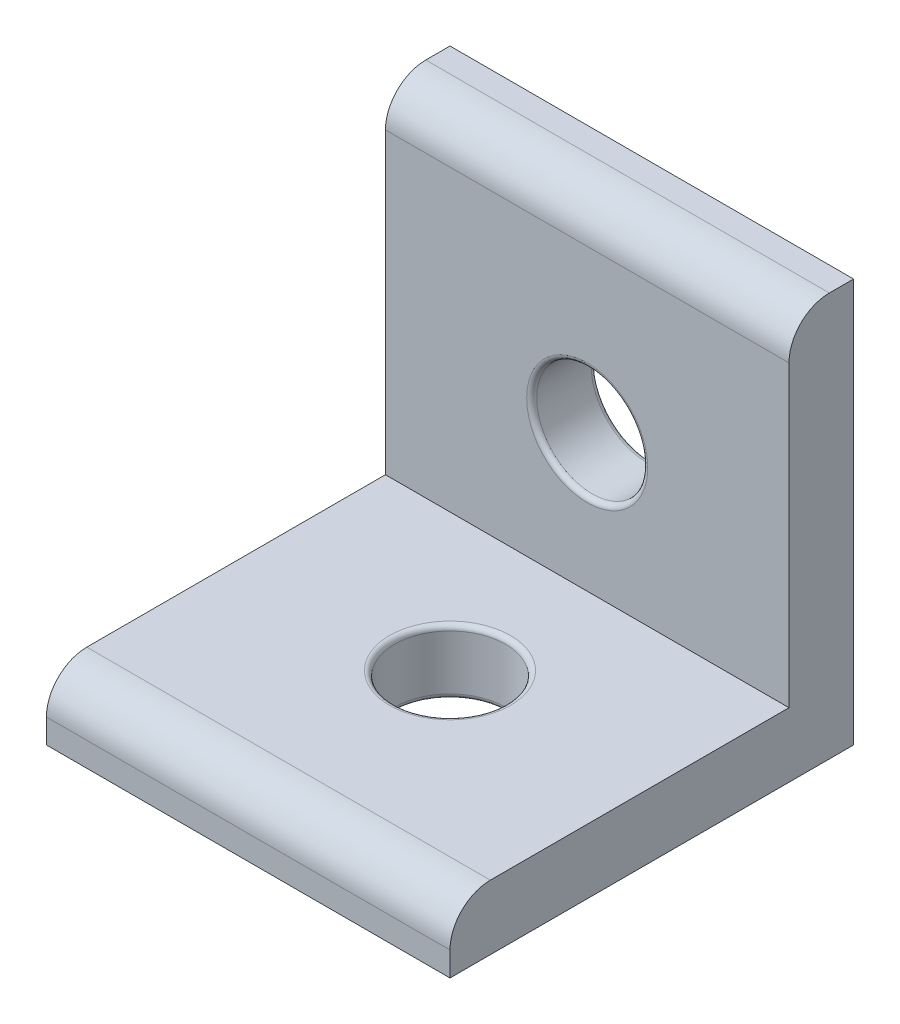
ISO-10303-21;
HEADER;
FILE_DESCRIPTION(('STEP AP214'),'2;1');
FILE_NAME('part.step','',(''),(''),'','','');
FILE_SCHEMA(('AUTOMOTIVE_DESIGN { 1 0 10303 214 1 1 1 1 }'));
ENDSEC;
DATA;
#1=APPLICATION_CONTEXT('core data for automotive mechanical design processes');
#2=APPLICATION_PROTOCOL_DEFINITION('international standard','automotive_design',2000,#1);
#3=PRODUCT_CONTEXT('',#1,'mechanical');
#4=PRODUCT('Part','Part','',(#3));
#5=PRODUCT_RELATED_PRODUCT_CATEGORY('part','',(#4));
#6=PRODUCT_DEFINITION_FORMATION('','',#4);
#7=PRODUCT_DEFINITION_CONTEXT('part definition',#1,'design');
#8=PRODUCT_DEFINITION('design','',#6,#7);
#9=PRODUCT_DEFINITION_SHAPE('','',#8);
#10=(LENGTH_UNIT() NAMED_UNIT(*) SI_UNIT(.MILLI.,.METRE.));
#11=(NAMED_UNIT(*) PLANE_ANGLE_UNIT() SI_UNIT($,.RADIAN.));
#12=(NAMED_UNIT(*) SI_UNIT($,.STERADIAN.) SOLID_ANGLE_UNIT());
#13=UNCERTAINTY_MEASURE_WITH_UNIT(LENGTH_MEASURE(1.E-05),#10,'distance_accuracy_value','');
#14=(GEOMETRIC_REPRESENTATION_CONTEXT(3) GLOBAL_UNCERTAINTY_ASSIGNED_CONTEXT((#13)) GLOBAL_UNIT_ASSIGNED_CONTEXT((#10,
#11,#12)) REPRESENTATION_CONTEXT('',''));
#15=CARTESIAN_POINT('',(0.,0.,0.));
#16=DIRECTION('',(0.,0.,1.));
#17=DIRECTION('',(1.,0.,0.));
#18=AXIS2_PLACEMENT_3D('',#15,#16,#17);
#19=CARTESIAN_POINT('',(0.,3.2,0.));
#20=DIRECTION('',(0.,-1.,0.));
#21=DIRECTION('',(0.,0.,-1.));
#22=AXIS2_PLACEMENT_3D('',#19,#20,#21);
#23=PLANE('',#22);
#24=CARTESIAN_POINT('',(0.,3.2,0.));
#25=DIRECTION('',(0.,-1.,0.));
#26=DIRECTION('',(0.,0.,-1.));
#27=AXIS2_PLACEMENT_3D('',#24,#25,#26);
#28=CIRCLE('',#27,3.);
#29=CARTESIAN_POINT('',(0.,3.2,-3.));
#30=VERTEX_POINT('',#29);
#31=EDGE_CURVE('E51',#30,#30,#28,.T.);
#32=ORIENTED_EDGE('',*,*,#31,.T.);
#33=EDGE_LOOP('',(#32));
#34=FACE_BOUND('',#33,.T.);
#35=DIRECTION('',(0.,0.,1.));
#36=VECTOR('',#35,1.);
#37=CARTESIAN_POINT('',(-10.,3.2,10.));
#38=LINE('',#37,#36);
#39=CARTESIAN_POINT('',(-10.,3.2,-6.8));
#40=VERTEX_POINT('',#39);
#41=CARTESIAN_POINT('',(-10.,3.2,8.));
#42=VERTEX_POINT('',#41);
#43=EDGE_CURVE('E147',#40,#42,#38,.T.);
#44=ORIENTED_EDGE('',*,*,#43,.T.);
#45=DIRECTION('',(1.,0.,0.));
#46=VECTOR('',#45,1.);
#47=CARTESIAN_POINT('',(0.,3.2,8.));
#48=LINE('',#47,#46);
#49=CARTESIAN_POINT('',(10.,3.2,8.));
#50=VERTEX_POINT('',#49);
#51=EDGE_CURVE('E173',#42,#50,#48,.T.);
#52=ORIENTED_EDGE('',*,*,#51,.T.);
#53=DIRECTION('',(0.,0.,-1.));
#54=VECTOR('',#53,1.);
#55=CARTESIAN_POINT('',(10.,3.2,10.));
#56=LINE('',#55,#54);
#57=CARTESIAN_POINT('',(10.,3.2,-6.8));
#58=VERTEX_POINT('',#57);
#59=EDGE_CURVE('E145',#50,#58,#56,.T.);
#60=ORIENTED_EDGE('',*,*,#59,.T.);
#61=DIRECTION('',(1.,0.,0.));
#62=VECTOR('',#61,1.);
#63=CARTESIAN_POINT('',(-10.,3.2,-6.8));
#64=LINE('',#63,#62);
#65=EDGE_CURVE('E141',#40,#58,#64,.T.);
#66=ORIENTED_EDGE('',*,*,#65,.F.);
#67=EDGE_LOOP('',(#44,#52,#60,#66));
#68=FACE_BOUND('',#67,.T.);
#69=ADVANCED_FACE('F43',(#34,#68),#23,.F.);
#70=CARTESIAN_POINT('',(10.,3.2,10.));
#71=DIRECTION('',(-1.,0.,0.));
#72=DIRECTION('',(0.,0.,1.));
#73=AXIS2_PLACEMENT_3D('',#70,#71,#72);
#74=PLANE('',#73);
#75=DIRECTION('',(0.,0.,-1.));
#76=VECTOR('',#75,1.);
#77=CARTESIAN_POINT('',(10.,20.,-10.));
#78=LINE('',#77,#76);
#79=CARTESIAN_POINT('',(10.,20.,-8.8));
#80=VERTEX_POINT('',#79);
#81=CARTESIAN_POINT('',(10.,20.,-10.));
#82=VERTEX_POINT('',#81);
#83=EDGE_CURVE('E111',#80,#82,#78,.T.);
#84=ORIENTED_EDGE('',*,*,#83,.F.);
#85=CARTESIAN_POINT('',(10.,18.,-8.8));
#86=DIRECTION('',(-1.,0.,0.));
#87=DIRECTION('',(0.,0.,1.));
#88=AXIS2_PLACEMENT_3D('',#85,#86,#87);
#89=CIRCLE('',#88,2.);
#90=CARTESIAN_POINT('',(10.,18.,-6.8));
#91=VERTEX_POINT('',#90);
#92=EDGE_CURVE('E166',#80,#91,#89,.F.);
#93=ORIENTED_EDGE('',*,*,#92,.T.);
#94=DIRECTION('',(0.,-1.,0.));
#95=VECTOR('',#94,1.);
#96=CARTESIAN_POINT('',(10.,20.,-6.8));
#97=LINE('',#96,#95);
#98=EDGE_CURVE('E134',#91,#58,#97,.T.);
#99=ORIENTED_EDGE('',*,*,#98,.T.);
#100=ORIENTED_EDGE('',*,*,#59,.F.);
#101=CARTESIAN_POINT('',(10.,1.2,8.));
#102=DIRECTION('',(-1.,0.,0.));
#103=DIRECTION('',(0.,0.,1.));
#104=AXIS2_PLACEMENT_3D('',#101,#102,#103);
#105=CIRCLE('',#104,2.);
#106=CARTESIAN_POINT('',(10.,1.2,10.));
#107=VERTEX_POINT('',#106);
#108=EDGE_CURVE('E164',#50,#107,#105,.F.);
#109=ORIENTED_EDGE('',*,*,#108,.T.);
#110=DIRECTION('',(0.,-1.,0.));
#111=VECTOR('',#110,1.);
#112=CARTESIAN_POINT('',(10.,3.2,10.));
#113=LINE('',#112,#111);
#114=CARTESIAN_POINT('',(10.,0.,10.));
#115=VERTEX_POINT('',#114);
#116=EDGE_CURVE('E150',#107,#115,#113,.T.);
#117=ORIENTED_EDGE('',*,*,#116,.T.);
#118=DIRECTION('',(0.,0.,-1.));
#119=VECTOR('',#118,1.);
#120=CARTESIAN_POINT('',(10.,0.,10.));
#121=LINE('',#120,#119);
#122=CARTESIAN_POINT('',(10.,0.,-10.));
#123=VERTEX_POINT('',#122);
#124=EDGE_CURVE('E128',#115,#123,#121,.T.);
#125=ORIENTED_EDGE('',*,*,#124,.T.);
#126=DIRECTION('',(0.,-1.,0.));
#127=VECTOR('',#126,1.);
#128=CARTESIAN_POINT('',(10.,3.2,-10.));
#129=LINE('',#128,#127);
#130=EDGE_CURVE('E125',#82,#123,#129,.T.);
#131=ORIENTED_EDGE('',*,*,#130,.F.);
#132=EDGE_LOOP('',(#84,#93,#99,#100,#109,#117,#125,#131));
#133=FACE_BOUND('',#132,.T.);
#134=ADVANCED_FACE('F126',(#133),#74,.F.);
#135=CARTESIAN_POINT('',(-10.,3.2,-10.));
#136=DIRECTION('',(0.,0.,1.));
#137=DIRECTION('',(1.,0.,0.));
#138=AXIS2_PLACEMENT_3D('',#135,#136,#137);
#139=PLANE('',#138);
#140=CARTESIAN_POINT('',(0.,10.,-10.));
#141=DIRECTION('',(0.,0.,1.));
#142=DIRECTION('',(1.,0.,0.));
#143=AXIS2_PLACEMENT_3D('',#140,#141,#142);
#144=CIRCLE('',#143,3.);
#145=CARTESIAN_POINT('',(3.,10.,-10.));
#146=VERTEX_POINT('',#145);
#147=EDGE_CURVE('E186',#146,#146,#144,.T.);
#148=ORIENTED_EDGE('',*,*,#147,.T.);
#149=EDGE_LOOP('',(#148));
#150=FACE_BOUND('',#149,.T.);
#151=DIRECTION('',(-1.,0.,0.));
#152=VECTOR('',#151,1.);
#153=CARTESIAN_POINT('',(-10.,0.,-10.));
#154=LINE('',#153,#152);
#155=CARTESIAN_POINT('',(-10.,0.,-10.));
#156=VERTEX_POINT('',#155);
#157=EDGE_CURVE('E152',#123,#156,#154,.T.);
#158=ORIENTED_EDGE('',*,*,#157,.T.);
#159=DIRECTION('',(0.,-1.,0.));
#160=VECTOR('',#159,1.);
#161=CARTESIAN_POINT('',(-10.,3.2,-10.));
#162=LINE('',#161,#160);
#163=CARTESIAN_POINT('',(-10.,20.,-10.));
#164=VERTEX_POINT('',#163);
#165=EDGE_CURVE('E130',#164,#156,#162,.T.);
#166=ORIENTED_EDGE('',*,*,#165,.F.);
#167=DIRECTION('',(-1.,0.,0.));
#168=VECTOR('',#167,1.);
#169=CARTESIAN_POINT('',(-10.,20.,-10.));
#170=LINE('',#169,#168);
#171=EDGE_CURVE('E116',#82,#164,#170,.T.);
#172=ORIENTED_EDGE('',*,*,#171,.F.);
#173=ORIENTED_EDGE('',*,*,#130,.T.);
#174=EDGE_LOOP('',(#158,#166,#172,#173));
#175=FACE_BOUND('',#174,.T.);
#176=ADVANCED_FACE('F132',(#150,#175),#139,.F.);
#177=CARTESIAN_POINT('',(-10.,3.2,10.));
#178=DIRECTION('',(1.,0.,0.));
#179=DIRECTION('',(0.,0.,-1.));
#180=AXIS2_PLACEMENT_3D('',#177,#178,#179);
#181=PLANE('',#180);
#182=DIRECTION('',(0.,-1.,0.));
#183=VECTOR('',#182,1.);
#184=CARTESIAN_POINT('',(-10.,20.,-6.8));
#185=LINE('',#184,#183);
#186=CARTESIAN_POINT('',(-10.,18.,-6.8));
#187=VERTEX_POINT('',#186);
#188=EDGE_CURVE('E137',#187,#40,#185,.T.);
#189=ORIENTED_EDGE('',*,*,#188,.F.);
#190=CARTESIAN_POINT('',(-10.,18.,-8.8));
#191=DIRECTION('',(1.,0.,0.));
#192=DIRECTION('',(0.,0.,-1.));
#193=AXIS2_PLACEMENT_3D('',#190,#191,#192);
#194=CIRCLE('',#193,2.);
#195=CARTESIAN_POINT('',(-10.,20.,-8.8));
#196=VERTEX_POINT('',#195);
#197=EDGE_CURVE('E171',#187,#196,#194,.F.);
#198=ORIENTED_EDGE('',*,*,#197,.T.);
#199=DIRECTION('',(0.,0.,1.));
#200=VECTOR('',#199,1.);
#201=CARTESIAN_POINT('',(-10.,20.,-10.));
#202=LINE('',#201,#200);
#203=EDGE_CURVE('E121',#164,#196,#202,.T.);
#204=ORIENTED_EDGE('',*,*,#203,.F.);
#205=ORIENTED_EDGE('',*,*,#165,.T.);
#206=DIRECTION('',(0.,0.,1.));
#207=VECTOR('',#206,1.);
#208=CARTESIAN_POINT('',(-10.,0.,10.));
#209=LINE('',#208,#207);
#210=CARTESIAN_POINT('',(-10.,0.,10.));
#211=VERTEX_POINT('',#210);
#212=EDGE_CURVE('E154',#156,#211,#209,.T.);
#213=ORIENTED_EDGE('',*,*,#212,.T.);
#214=DIRECTION('',(0.,-1.,0.));
#215=VECTOR('',#214,1.);
#216=CARTESIAN_POINT('',(-10.,3.2,10.));
#217=LINE('',#216,#215);
#218=CARTESIAN_POINT('',(-10.,1.2,10.));
#219=VERTEX_POINT('',#218);
#220=EDGE_CURVE('E160',#219,#211,#217,.T.);
#221=ORIENTED_EDGE('',*,*,#220,.F.);
#222=CARTESIAN_POINT('',(-10.,1.2,8.));
#223=DIRECTION('',(1.,0.,0.));
#224=DIRECTION('',(0.,0.,-1.));
#225=AXIS2_PLACEMENT_3D('',#222,#223,#224);
#226=CIRCLE('',#225,2.);
#227=EDGE_CURVE('E58',#219,#42,#226,.F.);
#228=ORIENTED_EDGE('',*,*,#227,.T.);
#229=ORIENTED_EDGE('',*,*,#43,.F.);
#230=EDGE_LOOP('',(#189,#198,#204,#205,#213,#221,#228,#229));
#231=FACE_BOUND('',#230,.T.);
#232=ADVANCED_FACE('F225',(#231),#181,.F.);
#233=CARTESIAN_POINT('',(-10.,3.2,10.));
#234=DIRECTION('',(0.,0.,-1.));
#235=DIRECTION('',(-1.,0.,0.));
#236=AXIS2_PLACEMENT_3D('',#233,#234,#235);
#237=PLANE('',#236);
#238=ORIENTED_EDGE('',*,*,#116,.F.);
#239=DIRECTION('',(1.,0.,0.));
#240=VECTOR('',#239,1.);
#241=CARTESIAN_POINT('',(-10.,1.2,10.));
#242=LINE('',#241,#240);
#243=EDGE_CURVE('E66',#107,#219,#242,.F.);
#244=ORIENTED_EDGE('',*,*,#243,.T.);
#245=ORIENTED_EDGE('',*,*,#220,.T.);
#246=DIRECTION('',(1.,0.,0.));
#247=VECTOR('',#246,1.);
#248=CARTESIAN_POINT('',(-10.,0.,10.));
#249=LINE('',#248,#247);
#250=EDGE_CURVE('E148',#211,#115,#249,.T.);
#251=ORIENTED_EDGE('',*,*,#250,.T.);
#252=EDGE_LOOP('',(#238,#244,#245,#251));
#253=FACE_BOUND('',#252,.T.);
#254=ADVANCED_FACE('F220',(#253),#237,.F.);
#255=CARTESIAN_POINT('',(0.,0.,0.));
#256=DIRECTION('',(0.,-1.,0.));
#257=DIRECTION('',(0.,0.,-1.));
#258=AXIS2_PLACEMENT_3D('',#255,#256,#257);
#259=PLANE('',#258);
#260=CARTESIAN_POINT('',(0.,0.,0.));
#261=DIRECTION('',(0.,-1.,0.));
#262=DIRECTION('',(0.,0.,-1.));
#263=AXIS2_PLACEMENT_3D('',#260,#261,#262);
#264=CIRCLE('',#263,3.);
#265=CARTESIAN_POINT('',(0.,0.,-3.));
#266=VERTEX_POINT('',#265);
#267=EDGE_CURVE('E11',#266,#266,#264,.F.);
#268=ORIENTED_EDGE('',*,*,#267,.T.);
#269=EDGE_LOOP('',(#268));
#270=FACE_BOUND('',#269,.T.);
#271=ORIENTED_EDGE('',*,*,#124,.F.);
#272=ORIENTED_EDGE('',*,*,#250,.F.);
#273=ORIENTED_EDGE('',*,*,#212,.F.);
#274=ORIENTED_EDGE('',*,*,#157,.F.);
#275=EDGE_LOOP('',(#271,#272,#273,#274));
#276=FACE_BOUND('',#275,.T.);
#277=ADVANCED_FACE('F216',(#270,#276),#259,.T.);
#278=CARTESIAN_POINT('',(-10.,20.,-6.8));
#279=DIRECTION('',(0.,0.,-1.));
#280=DIRECTION('',(-1.,0.,0.));
#281=AXIS2_PLACEMENT_3D('',#278,#279,#280);
#282=PLANE('',#281);
#283=CARTESIAN_POINT('',(0.,10.,-6.8));
#284=DIRECTION('',(0.,0.,-1.));
#285=DIRECTION('',(-1.,0.,0.));
#286=AXIS2_PLACEMENT_3D('',#283,#284,#285);
#287=CIRCLE('',#286,3.);
#288=CARTESIAN_POINT('',(-3.,10.,-6.8));
#289=VERTEX_POINT('',#288);
#290=EDGE_CURVE('E183',#289,#289,#287,.T.);
#291=ORIENTED_EDGE('',*,*,#290,.T.);
#292=EDGE_LOOP('',(#291));
#293=FACE_BOUND('',#292,.T.);
#294=ORIENTED_EDGE('',*,*,#98,.F.);
#295=DIRECTION('',(1.,0.,0.));
#296=VECTOR('',#295,1.);
#297=CARTESIAN_POINT('',(-10.,18.,-6.8));
#298=LINE('',#297,#296);
#299=EDGE_CURVE('E168',#91,#187,#298,.F.);
#300=ORIENTED_EDGE('',*,*,#299,.T.);
#301=ORIENTED_EDGE('',*,*,#188,.T.);
#302=ORIENTED_EDGE('',*,*,#65,.T.);
#303=EDGE_LOOP('',(#294,#300,#301,#302));
#304=FACE_BOUND('',#303,.T.);
#305=ADVANCED_FACE('F219',(#293,#304),#282,.F.);
#306=CARTESIAN_POINT('',(0.,20.,0.));
#307=DIRECTION('',(0.,1.,0.));
#308=DIRECTION('',(0.,0.,1.));
#309=AXIS2_PLACEMENT_3D('',#306,#307,#308);
#310=PLANE('',#309);
#311=ORIENTED_EDGE('',*,*,#203,.T.);
#312=DIRECTION('',(1.,0.,0.));
#313=VECTOR('',#312,1.);
#314=CARTESIAN_POINT('',(10.,20.,-8.8));
#315=LINE('',#314,#313);
#316=EDGE_CURVE('E119',#196,#80,#315,.T.);
#317=ORIENTED_EDGE('',*,*,#316,.T.);
#318=ORIENTED_EDGE('',*,*,#83,.T.);
#319=ORIENTED_EDGE('',*,*,#171,.T.);
#320=EDGE_LOOP('',(#311,#317,#318,#319));
#321=FACE_BOUND('',#320,.T.);
#322=ADVANCED_FACE('F114',(#321),#310,.T.);
#323=CARTESIAN_POINT('',(0.,0.,0.));
#324=DIRECTION('',(0.,1.,0.));
#325=DIRECTION('',(0.,0.,1.));
#326=AXIS2_PLACEMENT_3D('',#323,#324,#325);
#327=CYLINDRICAL_SURFACE('',#326,2.75);
#328=CARTESIAN_POINT('',(0.,2.95,0.));
#329=DIRECTION('',(0.,-1.,0.));
#330=DIRECTION('',(0.,0.,-1.));
#331=AXIS2_PLACEMENT_3D('',#328,#329,#330);
#332=CIRCLE('',#331,2.75);
#333=CARTESIAN_POINT('',(0.,2.95,-2.75));
#334=VERTEX_POINT('',#333);
#335=EDGE_CURVE('E192',#334,#334,#332,.F.);
#336=ORIENTED_EDGE('',*,*,#335,.T.);
#337=EDGE_LOOP('',(#336));
#338=FACE_BOUND('',#337,.T.);
#339=CARTESIAN_POINT('',(0.,0.25,0.));
#340=DIRECTION('',(0.,-1.,0.));
#341=DIRECTION('',(0.,0.,-1.));
#342=AXIS2_PLACEMENT_3D('',#339,#340,#341);
#343=CIRCLE('',#342,2.75);
#344=CARTESIAN_POINT('',(0.,0.25,-2.75));
#345=VERTEX_POINT('',#344);
#346=EDGE_CURVE('E189',#345,#345,#343,.T.);
#347=ORIENTED_EDGE('',*,*,#346,.T.);
#348=EDGE_LOOP('',(#347));
#349=FACE_BOUND('',#348,.T.);
#350=ADVANCED_FACE('F205',(#338,#349),#327,.F.);
#351=CARTESIAN_POINT('',(0.,10.,-10.));
#352=DIRECTION('',(0.,0.,1.));
#353=DIRECTION('',(1.,0.,0.));
#354=AXIS2_PLACEMENT_3D('',#351,#352,#353);
#355=CYLINDRICAL_SURFACE('',#354,2.75);
#356=CARTESIAN_POINT('',(0.,10.,-7.05));
#357=DIRECTION('',(0.,0.,-1.));
#358=DIRECTION('',(-1.,0.,0.));
#359=AXIS2_PLACEMENT_3D('',#356,#357,#358);
#360=CIRCLE('',#359,2.75);
#361=CARTESIAN_POINT('',(-2.75,10.,-7.05));
#362=VERTEX_POINT('',#361);
#363=EDGE_CURVE('E180',#362,#362,#360,.F.);
#364=ORIENTED_EDGE('',*,*,#363,.T.);
#365=EDGE_LOOP('',(#364));
#366=FACE_BOUND('',#365,.T.);
#367=CARTESIAN_POINT('',(0.,10.,-9.75));
#368=DIRECTION('',(0.,0.,1.));
#369=DIRECTION('',(1.,0.,0.));
#370=AXIS2_PLACEMENT_3D('',#367,#368,#369);
#371=CIRCLE('',#370,2.75);
#372=CARTESIAN_POINT('',(2.75,10.,-9.75));
#373=VERTEX_POINT('',#372);
#374=EDGE_CURVE('E177',#373,#373,#371,.F.);
#375=ORIENTED_EDGE('',*,*,#374,.T.);
#376=EDGE_LOOP('',(#375));
#377=FACE_BOUND('',#376,.T.);
#378=ADVANCED_FACE('F208',(#366,#377),#355,.F.);
#379=CARTESIAN_POINT('',(0.,18.,-8.8));
#380=DIRECTION('',(-1.,0.,0.));
#381=DIRECTION('',(0.,0.,1.));
#382=AXIS2_PLACEMENT_3D('',#379,#380,#381);
#383=CYLINDRICAL_SURFACE('',#382,2.);
#384=ORIENTED_EDGE('',*,*,#197,.F.);
#385=ORIENTED_EDGE('',*,*,#299,.F.);
#386=ORIENTED_EDGE('',*,*,#92,.F.);
#387=ORIENTED_EDGE('',*,*,#316,.F.);
#388=EDGE_LOOP('',(#384,#385,#386,#387));
#389=FACE_BOUND('',#388,.T.);
#390=ADVANCED_FACE('F228',(#389),#383,.T.);
#391=CARTESIAN_POINT('',(0.,1.2,8.));
#392=DIRECTION('',(1.,0.,0.));
#393=DIRECTION('',(0.,0.,-1.));
#394=AXIS2_PLACEMENT_3D('',#391,#392,#393);
#395=CYLINDRICAL_SURFACE('',#394,2.);
#396=ORIENTED_EDGE('',*,*,#227,.F.);
#397=ORIENTED_EDGE('',*,*,#243,.F.);
#398=ORIENTED_EDGE('',*,*,#108,.F.);
#399=ORIENTED_EDGE('',*,*,#51,.F.);
#400=EDGE_LOOP('',(#396,#397,#398,#399));
#401=FACE_BOUND('',#400,.T.);
#402=ADVANCED_FACE('F236',(#401),#395,.T.);
#403=CARTESIAN_POINT('',(0.,10.,-7.05));
#404=DIRECTION('',(0.,0.,-1.));
#405=DIRECTION('',(-1.,0.,0.));
#406=AXIS2_PLACEMENT_3D('',#403,#404,#405);
#407=TOROIDAL_SURFACE('',#406,3.,0.25);
#408=ORIENTED_EDGE('',*,*,#290,.F.);
#409=EDGE_LOOP('',(#408));
#410=FACE_BOUND('',#409,.T.);
#411=ORIENTED_EDGE('',*,*,#363,.F.);
#412=EDGE_LOOP('',(#411));
#413=FACE_BOUND('',#412,.T.);
#414=ADVANCED_FACE('F238',(#410,#413),#407,.T.);
#415=CARTESIAN_POINT('',(0.,10.,-9.75));
#416=DIRECTION('',(0.,0.,1.));
#417=DIRECTION('',(1.,0.,0.));
#418=AXIS2_PLACEMENT_3D('',#415,#416,#417);
#419=TOROIDAL_SURFACE('',#418,3.,0.25);
#420=ORIENTED_EDGE('',*,*,#374,.F.);
#421=EDGE_LOOP('',(#420));
#422=FACE_BOUND('',#421,.T.);
#423=ORIENTED_EDGE('',*,*,#147,.F.);
#424=EDGE_LOOP('',(#423));
#425=FACE_BOUND('',#424,.T.);
#426=ADVANCED_FACE('F202',(#422,#425),#419,.T.);
#427=CARTESIAN_POINT('',(0.,2.95,0.));
#428=DIRECTION('',(0.,-1.,0.));
#429=DIRECTION('',(0.,0.,-1.));
#430=AXIS2_PLACEMENT_3D('',#427,#428,#429);
#431=TOROIDAL_SURFACE('',#430,3.,0.25);
#432=ORIENTED_EDGE('',*,*,#31,.F.);
#433=EDGE_LOOP('',(#432));
#434=FACE_BOUND('',#433,.T.);
#435=ORIENTED_EDGE('',*,*,#335,.F.);
#436=EDGE_LOOP('',(#435));
#437=FACE_BOUND('',#436,.T.);
#438=ADVANCED_FACE('F199',(#434,#437),#431,.T.);
#439=CARTESIAN_POINT('',(0.,0.25,0.));
#440=DIRECTION('',(0.,-1.,0.));
#441=DIRECTION('',(0.,0.,-1.));
#442=AXIS2_PLACEMENT_3D('',#439,#440,#441);
#443=TOROIDAL_SURFACE('',#442,3.,0.25);
#444=ORIENTED_EDGE('',*,*,#346,.F.);
#445=EDGE_LOOP('',(#444));
#446=FACE_BOUND('',#445,.T.);
#447=ORIENTED_EDGE('',*,*,#267,.F.);
#448=EDGE_LOOP('',(#447));
#449=FACE_BOUND('',#448,.T.);
#450=ADVANCED_FACE('F45',(#446,#449),#443,.T.);
#451=CLOSED_SHELL('',(#69,#134,#176,#232,#254,#277,#305,#322,#350,#378,#390,#402,#414,#426,#438,#450));
#452=MANIFOLD_SOLID_BREP('B2',#451);
#453=ADVANCED_BREP_SHAPE_REPRESENTATION('',(#18,#452),#14);
#454=SHAPE_DEFINITION_REPRESENTATION(#9,#453);
ENDSEC;
END-ISO-10303-21;
